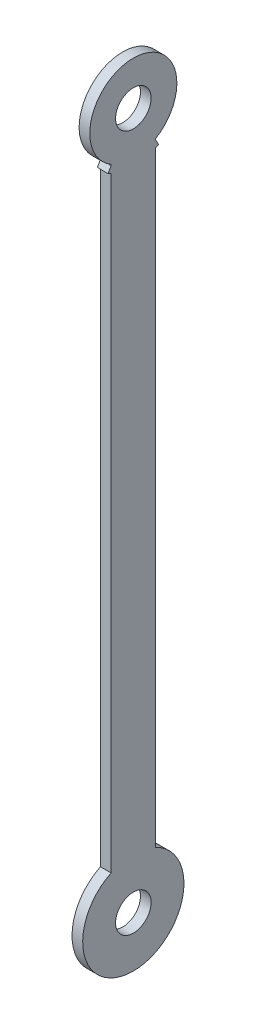
ISO-10303-21;
HEADER;
FILE_DESCRIPTION(('STEP AP214'),'2;1');
FILE_NAME('part.step','',(''),(''),'','','');
FILE_SCHEMA(('AUTOMOTIVE_DESIGN { 1 0 10303 214 1 1 1 1 }'));
ENDSEC;
DATA;
#1=APPLICATION_CONTEXT('core data for automotive mechanical design processes');
#2=APPLICATION_PROTOCOL_DEFINITION('international standard','automotive_design',2000,#1);
#3=PRODUCT_CONTEXT('',#1,'mechanical');
#4=PRODUCT('Part','Part','',(#3));
#5=PRODUCT_RELATED_PRODUCT_CATEGORY('part','',(#4));
#6=PRODUCT_DEFINITION_FORMATION('','',#4);
#7=PRODUCT_DEFINITION_CONTEXT('part definition',#1,'design');
#8=PRODUCT_DEFINITION('design','',#6,#7);
#9=PRODUCT_DEFINITION_SHAPE('','',#8);
#10=(LENGTH_UNIT() NAMED_UNIT(*) SI_UNIT(.MILLI.,.METRE.));
#11=(NAMED_UNIT(*) PLANE_ANGLE_UNIT() SI_UNIT($,.RADIAN.));
#12=(NAMED_UNIT(*) SI_UNIT($,.STERADIAN.) SOLID_ANGLE_UNIT());
#13=UNCERTAINTY_MEASURE_WITH_UNIT(LENGTH_MEASURE(1.E-05),#10,'distance_accuracy_value','');
#14=(GEOMETRIC_REPRESENTATION_CONTEXT(3) GLOBAL_UNCERTAINTY_ASSIGNED_CONTEXT((#13)) GLOBAL_UNIT_ASSIGNED_CONTEXT((#10,
#11,#12)) REPRESENTATION_CONTEXT('',''));
#15=CARTESIAN_POINT('',(0.,0.,0.));
#16=DIRECTION('',(0.,0.,1.));
#17=DIRECTION('',(1.,0.,0.));
#18=AXIS2_PLACEMENT_3D('',#15,#16,#17);
#19=CARTESIAN_POINT('',(3.,0.,12.5));
#20=DIRECTION('',(0.,0.,-1.));
#21=DIRECTION('',(-1.,0.,0.));
#22=AXIS2_PLACEMENT_3D('',#19,#20,#21);
#23=PLANE('',#22);
#24=DIRECTION('',(0.,-1.,0.));
#25=VECTOR('',#24,1.);
#26=CARTESIAN_POINT('',(-3.,0.,12.5));
#27=LINE('',#26,#25);
#28=CARTESIAN_POINT('',(-3.,170.387503050269,12.5));
#29=VERTEX_POINT('',#28);
#30=CARTESIAN_POINT('',(-3.,-170.387503050269,12.5));
#31=VERTEX_POINT('',#30);
#32=EDGE_CURVE('E147',#29,#31,#27,.T.);
#33=ORIENTED_EDGE('',*,*,#32,.T.);
#34=DIRECTION('',(-1.,0.,0.));
#35=VECTOR('',#34,1.);
#36=CARTESIAN_POINT('',(3.,-170.387503050269,12.5));
#37=LINE('',#36,#35);
#38=CARTESIAN_POINT('',(3.,-170.387503050269,12.5));
#39=VERTEX_POINT('',#38);
#40=EDGE_CURVE('E11',#39,#31,#37,.T.);
#41=ORIENTED_EDGE('',*,*,#40,.F.);
#42=DIRECTION('',(0.,-1.,0.));
#43=VECTOR('',#42,1.);
#44=CARTESIAN_POINT('',(3.,0.,12.5));
#45=LINE('',#44,#43);
#46=CARTESIAN_POINT('',(3.,170.387503050269,12.5));
#47=VERTEX_POINT('',#46);
#48=EDGE_CURVE('E168',#47,#39,#45,.T.);
#49=ORIENTED_EDGE('',*,*,#48,.F.);
#50=DIRECTION('',(-1.,0.,0.));
#51=VECTOR('',#50,1.);
#52=CARTESIAN_POINT('',(3.,170.387503050269,12.5));
#53=LINE('',#52,#51);
#54=EDGE_CURVE('E143',#47,#29,#53,.T.);
#55=ORIENTED_EDGE('',*,*,#54,.T.);
#56=EDGE_LOOP('',(#33,#41,#49,#55));
#57=FACE_BOUND('',#56,.T.);
#58=ADVANCED_FACE('F39',(#57),#23,.F.);
#59=CARTESIAN_POINT('',(3.,-196.,0.));
#60=DIRECTION('',(-1.,0.,0.));
#61=DIRECTION('',(0.,0.,1.));
#62=AXIS2_PLACEMENT_3D('',#59,#60,#61);
#63=CYLINDRICAL_SURFACE('',#62,28.5);
#64=CARTESIAN_POINT('',(-3.,-196.,0.));
#65=DIRECTION('',(1.,0.,0.));
#66=DIRECTION('',(0.,0.,-1.));
#67=AXIS2_PLACEMENT_3D('',#64,#65,#66);
#68=CIRCLE('',#67,28.5);
#69=CARTESIAN_POINT('',(-3.,-170.387503050269,-12.5));
#70=VERTEX_POINT('',#69);
#71=EDGE_CURVE('E150',#31,#70,#68,.T.);
#72=ORIENTED_EDGE('',*,*,#71,.T.);
#73=DIRECTION('',(-1.,0.,0.));
#74=VECTOR('',#73,1.);
#75=CARTESIAN_POINT('',(3.,-170.387503050269,-12.5));
#76=LINE('',#75,#74);
#77=CARTESIAN_POINT('',(3.,-170.387503050269,-12.5));
#78=VERTEX_POINT('',#77);
#79=EDGE_CURVE('E47',#78,#70,#76,.T.);
#80=ORIENTED_EDGE('',*,*,#79,.F.);
#81=CARTESIAN_POINT('',(3.,-196.,0.));
#82=DIRECTION('',(1.,0.,0.));
#83=DIRECTION('',(0.,0.,-1.));
#84=AXIS2_PLACEMENT_3D('',#81,#82,#83);
#85=CIRCLE('',#84,28.5);
#86=EDGE_CURVE('E104',#39,#78,#85,.T.);
#87=ORIENTED_EDGE('',*,*,#86,.F.);
#88=ORIENTED_EDGE('',*,*,#40,.T.);
#89=EDGE_LOOP('',(#72,#80,#87,#88));
#90=FACE_BOUND('',#89,.T.);
#91=ADVANCED_FACE('F230',(#90),#63,.T.);
#92=CARTESIAN_POINT('',(3.,0.,-12.5));
#93=DIRECTION('',(0.,0.,1.));
#94=DIRECTION('',(1.,0.,0.));
#95=AXIS2_PLACEMENT_3D('',#92,#93,#94);
#96=PLANE('',#95);
#97=DIRECTION('',(0.,1.,0.));
#98=VECTOR('',#97,1.);
#99=CARTESIAN_POINT('',(-3.,0.,-12.5));
#100=LINE('',#99,#98);
#101=CARTESIAN_POINT('',(-3.,170.387503050269,-12.5));
#102=VERTEX_POINT('',#101);
#103=EDGE_CURVE('E153',#70,#102,#100,.T.);
#104=ORIENTED_EDGE('',*,*,#103,.T.);
#105=DIRECTION('',(-1.,0.,0.));
#106=VECTOR('',#105,1.);
#107=CARTESIAN_POINT('',(3.,170.387503050269,-12.5));
#108=LINE('',#107,#106);
#109=CARTESIAN_POINT('',(3.,170.387503050269,-12.5));
#110=VERTEX_POINT('',#109);
#111=EDGE_CURVE('E179',#110,#102,#108,.T.);
#112=ORIENTED_EDGE('',*,*,#111,.F.);
#113=DIRECTION('',(0.,1.,0.));
#114=VECTOR('',#113,1.);
#115=CARTESIAN_POINT('',(3.,0.,-12.5));
#116=LINE('',#115,#114);
#117=EDGE_CURVE('E187',#78,#110,#116,.T.);
#118=ORIENTED_EDGE('',*,*,#117,.F.);
#119=ORIENTED_EDGE('',*,*,#79,.T.);
#120=EDGE_LOOP('',(#104,#112,#118,#119));
#121=FACE_BOUND('',#120,.T.);
#122=ADVANCED_FACE('F185',(#121),#96,.F.);
#123=CARTESIAN_POINT('',(3.,196.,0.));
#124=DIRECTION('',(-1.,0.,0.));
#125=DIRECTION('',(0.,0.,1.));
#126=AXIS2_PLACEMENT_3D('',#123,#124,#125);
#127=CYLINDRICAL_SURFACE('',#126,28.5);
#128=CARTESIAN_POINT('',(-3.,196.,0.));
#129=DIRECTION('',(1.,0.,0.));
#130=DIRECTION('',(0.,0.,-1.));
#131=AXIS2_PLACEMENT_3D('',#128,#129,#130);
#132=CIRCLE('',#131,28.5);
#133=CARTESIAN_POINT('',(-3.,171.318275992144,-14.2500000000002));
#134=VERTEX_POINT('',#133);
#135=EDGE_CURVE('E155',#102,#134,#132,.T.);
#136=ORIENTED_EDGE('',*,*,#135,.T.);
#137=DIRECTION('',(-1.,0.,0.));
#138=VECTOR('',#137,1.);
#139=CARTESIAN_POINT('',(3.,171.318275992144,-14.2500000000002));
#140=LINE('',#139,#138);
#141=CARTESIAN_POINT('',(3.,171.318275992144,-14.2500000000002));
#142=VERTEX_POINT('',#141);
#143=EDGE_CURVE('E177',#142,#134,#140,.T.);
#144=ORIENTED_EDGE('',*,*,#143,.F.);
#145=CARTESIAN_POINT('',(3.,196.,0.));
#146=DIRECTION('',(1.,0.,0.));
#147=DIRECTION('',(0.,0.,-1.));
#148=AXIS2_PLACEMENT_3D('',#145,#146,#147);
#149=CIRCLE('',#148,28.5);
#150=EDGE_CURVE('E199',#110,#142,#149,.T.);
#151=ORIENTED_EDGE('',*,*,#150,.F.);
#152=ORIENTED_EDGE('',*,*,#111,.T.);
#153=EDGE_LOOP('',(#136,#144,#151,#152));
#154=FACE_BOUND('',#153,.T.);
#155=ADVANCED_FACE('F196',(#154),#127,.T.);
#156=CARTESIAN_POINT('',(3.,49.0000000000014,-84.8704895708758));
#157=DIRECTION('',(0.,0.500000000000007,-0.866025403784434));
#158=DIRECTION('',(0.,0.866025403784435,0.500000000000007));
#159=AXIS2_PLACEMENT_3D('',#156,#157,#158);
#160=PLANE('',#159);
#161=DIRECTION('',(0.,-0.866025403784434,-0.500000000000007));
#162=VECTOR('',#161,1.);
#163=CARTESIAN_POINT('',(-3.,49.0000000000014,-84.8704895708758));
#164=LINE('',#163,#162);
#165=CARTESIAN_POINT('',(-3.,174.349364905389,-12.5));
#166=VERTEX_POINT('',#165);
#167=EDGE_CURVE('E158',#166,#134,#164,.T.);
#168=ORIENTED_EDGE('',*,*,#167,.F.);
#169=DIRECTION('',(-1.,0.,0.));
#170=VECTOR('',#169,1.);
#171=CARTESIAN_POINT('',(3.,174.349364905389,-12.5));
#172=LINE('',#171,#170);
#173=CARTESIAN_POINT('',(3.,174.349364905389,-12.5));
#174=VERTEX_POINT('',#173);
#175=EDGE_CURVE('E175',#174,#166,#172,.T.);
#176=ORIENTED_EDGE('',*,*,#175,.F.);
#177=DIRECTION('',(0.,-0.866025403784434,-0.500000000000007));
#178=VECTOR('',#177,1.);
#179=CARTESIAN_POINT('',(3.,49.0000000000014,-84.8704895708758));
#180=LINE('',#179,#178);
#181=EDGE_CURVE('E201',#174,#142,#180,.T.);
#182=ORIENTED_EDGE('',*,*,#181,.T.);
#183=ORIENTED_EDGE('',*,*,#143,.T.);
#184=EDGE_LOOP('',(#168,#176,#182,#183));
#185=FACE_BOUND('',#184,.T.);
#186=ADVANCED_FACE('F241',(#185),#160,.T.);
#187=CARTESIAN_POINT('',(3.,0.,-12.5));
#188=DIRECTION('',(0.,0.,1.));
#189=DIRECTION('',(1.,0.,0.));
#190=AXIS2_PLACEMENT_3D('',#187,#188,#189);
#191=PLANE('',#190);
#192=DIRECTION('',(0.,1.,0.));
#193=VECTOR('',#192,1.);
#194=CARTESIAN_POINT('',(-3.,0.,-12.5));
#195=LINE('',#194,#193);
#196=CARTESIAN_POINT('',(-3.,174.928692494295,-12.5));
#197=VERTEX_POINT('',#196);
#198=EDGE_CURVE('E161',#166,#197,#195,.T.);
#199=ORIENTED_EDGE('',*,*,#198,.T.);
#200=DIRECTION('',(-1.,0.,0.));
#201=VECTOR('',#200,1.);
#202=CARTESIAN_POINT('',(3.,174.928692494295,-12.5));
#203=LINE('',#202,#201);
#204=CARTESIAN_POINT('',(3.,174.928692494295,-12.5));
#205=VERTEX_POINT('',#204);
#206=EDGE_CURVE('E172',#205,#197,#203,.T.);
#207=ORIENTED_EDGE('',*,*,#206,.F.);
#208=DIRECTION('',(0.,1.,0.));
#209=VECTOR('',#208,1.);
#210=CARTESIAN_POINT('',(3.,0.,-12.5));
#211=LINE('',#210,#209);
#212=EDGE_CURVE('E203',#174,#205,#211,.T.);
#213=ORIENTED_EDGE('',*,*,#212,.F.);
#214=ORIENTED_EDGE('',*,*,#175,.T.);
#215=EDGE_LOOP('',(#199,#207,#213,#214));
#216=FACE_BOUND('',#215,.T.);
#217=ADVANCED_FACE('F211',(#216),#191,.F.);
#218=CARTESIAN_POINT('',(3.,196.,0.));
#219=DIRECTION('',(-1.,0.,0.));
#220=DIRECTION('',(0.,0.,1.));
#221=AXIS2_PLACEMENT_3D('',#218,#219,#220);
#222=CYLINDRICAL_SURFACE('',#221,24.5);
#223=CARTESIAN_POINT('',(-3.,196.,0.));
#224=DIRECTION('',(1.,0.,0.));
#225=DIRECTION('',(0.,0.,-1.));
#226=AXIS2_PLACEMENT_3D('',#223,#224,#225);
#227=CIRCLE('',#226,24.5);
#228=CARTESIAN_POINT('',(-3.,174.928692494295,12.5));
#229=VERTEX_POINT('',#228);
#230=EDGE_CURVE('E163',#197,#229,#227,.T.);
#231=ORIENTED_EDGE('',*,*,#230,.T.);
#232=DIRECTION('',(-1.,0.,0.));
#233=VECTOR('',#232,1.);
#234=CARTESIAN_POINT('',(3.,174.928692494295,12.5));
#235=LINE('',#234,#233);
#236=CARTESIAN_POINT('',(3.,174.928692494295,12.5));
#237=VERTEX_POINT('',#236);
#238=EDGE_CURVE('E138',#237,#229,#235,.T.);
#239=ORIENTED_EDGE('',*,*,#238,.F.);
#240=CARTESIAN_POINT('',(3.,196.,0.));
#241=DIRECTION('',(1.,0.,0.));
#242=DIRECTION('',(0.,0.,-1.));
#243=AXIS2_PLACEMENT_3D('',#240,#241,#242);
#244=CIRCLE('',#243,24.5);
#245=EDGE_CURVE('E129',#205,#237,#244,.T.);
#246=ORIENTED_EDGE('',*,*,#245,.F.);
#247=ORIENTED_EDGE('',*,*,#206,.T.);
#248=EDGE_LOOP('',(#231,#239,#246,#247));
#249=FACE_BOUND('',#248,.T.);
#250=ADVANCED_FACE('F214',(#249),#222,.T.);
#251=CARTESIAN_POINT('',(3.,0.,12.5));
#252=DIRECTION('',(0.,0.,-1.));
#253=DIRECTION('',(-1.,0.,0.));
#254=AXIS2_PLACEMENT_3D('',#251,#252,#253);
#255=PLANE('',#254);
#256=DIRECTION('',(0.,-1.,0.));
#257=VECTOR('',#256,1.);
#258=CARTESIAN_POINT('',(-3.,0.,12.5));
#259=LINE('',#258,#257);
#260=CARTESIAN_POINT('',(-3.,174.349364905389,12.5));
#261=VERTEX_POINT('',#260);
#262=EDGE_CURVE('E137',#229,#261,#259,.T.);
#263=ORIENTED_EDGE('',*,*,#262,.T.);
#264=DIRECTION('',(-1.,0.,0.));
#265=VECTOR('',#264,1.);
#266=CARTESIAN_POINT('',(3.,174.349364905389,12.5));
#267=LINE('',#266,#265);
#268=CARTESIAN_POINT('',(3.,174.349364905389,12.5));
#269=VERTEX_POINT('',#268);
#270=EDGE_CURVE('E134',#269,#261,#267,.T.);
#271=ORIENTED_EDGE('',*,*,#270,.F.);
#272=DIRECTION('',(0.,-1.,0.));
#273=VECTOR('',#272,1.);
#274=CARTESIAN_POINT('',(3.,0.,12.5));
#275=LINE('',#274,#273);
#276=EDGE_CURVE('E123',#237,#269,#275,.T.);
#277=ORIENTED_EDGE('',*,*,#276,.F.);
#278=ORIENTED_EDGE('',*,*,#238,.T.);
#279=EDGE_LOOP('',(#263,#271,#277,#278));
#280=FACE_BOUND('',#279,.T.);
#281=ADVANCED_FACE('F135',(#280),#255,.F.);
#282=CARTESIAN_POINT('',(3.,49.0000000000014,84.8704895708758));
#283=DIRECTION('',(0.,-0.500000000000007,-0.866025403784434));
#284=DIRECTION('',(0.,0.866025403784435,-0.500000000000007));
#285=AXIS2_PLACEMENT_3D('',#282,#283,#284);
#286=PLANE('',#285);
#287=DIRECTION('',(0.,-0.866025403784434,0.500000000000007));
#288=VECTOR('',#287,1.);
#289=CARTESIAN_POINT('',(-3.,49.0000000000014,84.8704895708758));
#290=LINE('',#289,#288);
#291=CARTESIAN_POINT('',(-3.,171.318275992144,14.2500000000002));
#292=VERTEX_POINT('',#291);
#293=EDGE_CURVE('E90',#261,#292,#290,.T.);
#294=ORIENTED_EDGE('',*,*,#293,.T.);
#295=DIRECTION('',(-1.,0.,0.));
#296=VECTOR('',#295,1.);
#297=CARTESIAN_POINT('',(3.,171.318275992144,14.2500000000002));
#298=LINE('',#297,#296);
#299=CARTESIAN_POINT('',(3.,171.318275992144,14.2500000000002));
#300=VERTEX_POINT('',#299);
#301=EDGE_CURVE('E139',#300,#292,#298,.T.);
#302=ORIENTED_EDGE('',*,*,#301,.F.);
#303=DIRECTION('',(0.,-0.866025403784434,0.500000000000007));
#304=VECTOR('',#303,1.);
#305=CARTESIAN_POINT('',(3.,49.0000000000014,84.8704895708758));
#306=LINE('',#305,#304);
#307=EDGE_CURVE('E127',#269,#300,#306,.T.);
#308=ORIENTED_EDGE('',*,*,#307,.F.);
#309=ORIENTED_EDGE('',*,*,#270,.T.);
#310=EDGE_LOOP('',(#294,#302,#308,#309));
#311=FACE_BOUND('',#310,.T.);
#312=ADVANCED_FACE('F141',(#311),#286,.F.);
#313=CARTESIAN_POINT('',(3.,196.,0.));
#314=DIRECTION('',(-1.,0.,0.));
#315=DIRECTION('',(0.,0.,1.));
#316=AXIS2_PLACEMENT_3D('',#313,#314,#315);
#317=CYLINDRICAL_SURFACE('',#316,28.5);
#318=CARTESIAN_POINT('',(-3.,196.,0.));
#319=DIRECTION('',(1.,0.,0.));
#320=DIRECTION('',(0.,0.,-1.));
#321=AXIS2_PLACEMENT_3D('',#318,#319,#320);
#322=CIRCLE('',#321,28.5);
#323=EDGE_CURVE('E96',#292,#29,#322,.T.);
#324=ORIENTED_EDGE('',*,*,#323,.T.);
#325=ORIENTED_EDGE('',*,*,#54,.F.);
#326=CARTESIAN_POINT('',(3.,196.,0.));
#327=DIRECTION('',(1.,0.,0.));
#328=DIRECTION('',(0.,0.,-1.));
#329=AXIS2_PLACEMENT_3D('',#326,#327,#328);
#330=CIRCLE('',#329,28.5);
#331=EDGE_CURVE('E55',#300,#47,#330,.T.);
#332=ORIENTED_EDGE('',*,*,#331,.F.);
#333=ORIENTED_EDGE('',*,*,#301,.T.);
#334=EDGE_LOOP('',(#324,#325,#332,#333));
#335=FACE_BOUND('',#334,.T.);
#336=ADVANCED_FACE('F218',(#335),#317,.T.);
#337=CARTESIAN_POINT('',(3.,0.,0.));
#338=DIRECTION('',(1.,0.,0.));
#339=DIRECTION('',(0.,0.,-1.));
#340=AXIS2_PLACEMENT_3D('',#337,#338,#339);
#341=PLANE('',#340);
#342=CARTESIAN_POINT('',(3.,-196.,0.));
#343=DIRECTION('',(1.,0.,0.));
#344=DIRECTION('',(0.,0.,-1.));
#345=AXIS2_PLACEMENT_3D('',#342,#343,#344);
#346=CIRCLE('',#345,10.);
#347=CARTESIAN_POINT('',(3.,-196.,-10.));
#348=VERTEX_POINT('',#347);
#349=EDGE_CURVE('E425',#348,#348,#346,.T.);
#350=ORIENTED_EDGE('',*,*,#349,.F.);
#351=EDGE_LOOP('',(#350));
#352=FACE_BOUND('',#351,.T.);
#353=CARTESIAN_POINT('',(3.,196.,0.));
#354=DIRECTION('',(1.,0.,0.));
#355=DIRECTION('',(0.,0.,-1.));
#356=AXIS2_PLACEMENT_3D('',#353,#354,#355);
#357=CIRCLE('',#356,10.);
#358=CARTESIAN_POINT('',(3.,196.,-10.));
#359=VERTEX_POINT('',#358);
#360=EDGE_CURVE('E426',#359,#359,#357,.T.);
#361=ORIENTED_EDGE('',*,*,#360,.F.);
#362=EDGE_LOOP('',(#361));
#363=FACE_BOUND('',#362,.T.);
#364=ORIENTED_EDGE('',*,*,#48,.T.);
#365=ORIENTED_EDGE('',*,*,#86,.T.);
#366=ORIENTED_EDGE('',*,*,#117,.T.);
#367=ORIENTED_EDGE('',*,*,#150,.T.);
#368=ORIENTED_EDGE('',*,*,#181,.F.);
#369=ORIENTED_EDGE('',*,*,#212,.T.);
#370=ORIENTED_EDGE('',*,*,#245,.T.);
#371=ORIENTED_EDGE('',*,*,#276,.T.);
#372=ORIENTED_EDGE('',*,*,#307,.T.);
#373=ORIENTED_EDGE('',*,*,#331,.T.);
#374=EDGE_LOOP('',(#364,#365,#366,#367,#368,#369,#370,#371,#372,#373));
#375=FACE_BOUND('',#374,.T.);
#376=ADVANCED_FACE('F125',(#352,#363,#375),#341,.T.);
#377=CARTESIAN_POINT('',(-3.,0.,0.));
#378=DIRECTION('',(1.,0.,0.));
#379=DIRECTION('',(0.,0.,-1.));
#380=AXIS2_PLACEMENT_3D('',#377,#378,#379);
#381=PLANE('',#380);
#382=CARTESIAN_POINT('',(-3.,-196.,0.));
#383=DIRECTION('',(1.,0.,0.));
#384=DIRECTION('',(0.,0.,-1.));
#385=AXIS2_PLACEMENT_3D('',#382,#383,#384);
#386=CIRCLE('',#385,10.);
#387=CARTESIAN_POINT('',(-3.,-196.,-10.));
#388=VERTEX_POINT('',#387);
#389=EDGE_CURVE('E151',#388,#388,#386,.T.);
#390=ORIENTED_EDGE('',*,*,#389,.T.);
#391=EDGE_LOOP('',(#390));
#392=FACE_BOUND('',#391,.T.);
#393=CARTESIAN_POINT('',(-3.,196.,0.));
#394=DIRECTION('',(1.,0.,0.));
#395=DIRECTION('',(0.,0.,-1.));
#396=AXIS2_PLACEMENT_3D('',#393,#394,#395);
#397=CIRCLE('',#396,10.);
#398=CARTESIAN_POINT('',(-3.,196.,-10.));
#399=VERTEX_POINT('',#398);
#400=EDGE_CURVE('E430',#399,#399,#397,.T.);
#401=ORIENTED_EDGE('',*,*,#400,.T.);
#402=EDGE_LOOP('',(#401));
#403=FACE_BOUND('',#402,.T.);
#404=ORIENTED_EDGE('',*,*,#32,.F.);
#405=ORIENTED_EDGE('',*,*,#323,.F.);
#406=ORIENTED_EDGE('',*,*,#293,.F.);
#407=ORIENTED_EDGE('',*,*,#262,.F.);
#408=ORIENTED_EDGE('',*,*,#230,.F.);
#409=ORIENTED_EDGE('',*,*,#198,.F.);
#410=ORIENTED_EDGE('',*,*,#167,.T.);
#411=ORIENTED_EDGE('',*,*,#135,.F.);
#412=ORIENTED_EDGE('',*,*,#103,.F.);
#413=ORIENTED_EDGE('',*,*,#71,.F.);
#414=EDGE_LOOP('',(#404,#405,#406,#407,#408,#409,#410,#411,#412,#413));
#415=FACE_BOUND('',#414,.T.);
#416=ADVANCED_FACE('F191',(#392,#403,#415),#381,.F.);
#417=CARTESIAN_POINT('',(-3.,196.,0.));
#418=DIRECTION('',(1.,0.,0.));
#419=DIRECTION('',(0.,0.,-1.));
#420=AXIS2_PLACEMENT_3D('',#417,#418,#419);
#421=CYLINDRICAL_SURFACE('',#420,10.);
#422=ORIENTED_EDGE('',*,*,#400,.F.);
#423=EDGE_LOOP('',(#422));
#424=FACE_BOUND('',#423,.T.);
#425=ORIENTED_EDGE('',*,*,#360,.T.);
#426=EDGE_LOOP('',(#425));
#427=FACE_BOUND('',#426,.T.);
#428=ADVANCED_FACE('F282',(#424,#427),#421,.F.);
#429=CARTESIAN_POINT('',(-3.,-196.,0.));
#430=DIRECTION('',(1.,0.,0.));
#431=DIRECTION('',(0.,0.,-1.));
#432=AXIS2_PLACEMENT_3D('',#429,#430,#431);
#433=CYLINDRICAL_SURFACE('',#432,10.);
#434=ORIENTED_EDGE('',*,*,#389,.F.);
#435=EDGE_LOOP('',(#434));
#436=FACE_BOUND('',#435,.T.);
#437=ORIENTED_EDGE('',*,*,#349,.T.);
#438=EDGE_LOOP('',(#437));
#439=FACE_BOUND('',#438,.T.);
#440=ADVANCED_FACE('F292',(#436,#439),#433,.F.);
#441=CLOSED_SHELL('',(#58,#91,#122,#155,#186,#217,#250,#281,#312,#336,#376,#416,#428,#440));
#442=MANIFOLD_SOLID_BREP('B2',#441);
#443=ADVANCED_BREP_SHAPE_REPRESENTATION('',(#18,#442),#14);
#444=SHAPE_DEFINITION_REPRESENTATION(#9,#443);
ENDSEC;
END-ISO-10303-21;
